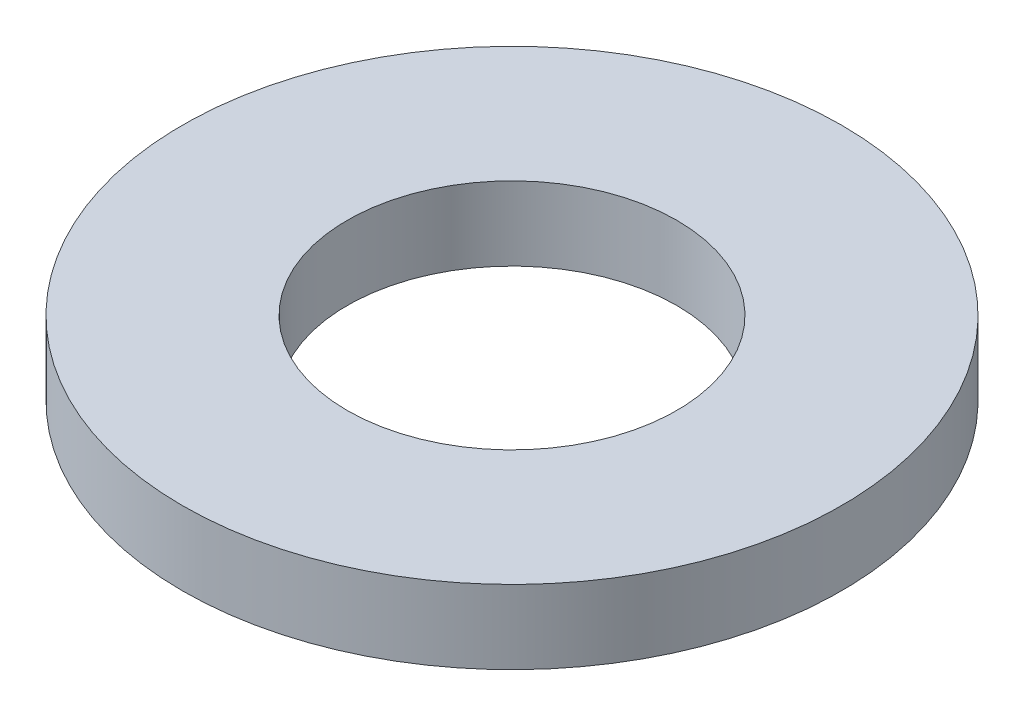
ISO-10303-21;
HEADER;
FILE_DESCRIPTION(('STEP AP214'),'2;1');
FILE_NAME('part.step','',(''),(''),'','','');
FILE_SCHEMA(('AUTOMOTIVE_DESIGN { 1 0 10303 214 1 1 1 1 }'));
ENDSEC;
DATA;
#1=APPLICATION_CONTEXT('core data for automotive mechanical design processes');
#2=APPLICATION_PROTOCOL_DEFINITION('international standard','automotive_design',2000,#1);
#3=PRODUCT_CONTEXT('',#1,'mechanical');
#4=PRODUCT('Part','Part','',(#3));
#5=PRODUCT_RELATED_PRODUCT_CATEGORY('part','',(#4));
#6=PRODUCT_DEFINITION_FORMATION('','',#4);
#7=PRODUCT_DEFINITION_CONTEXT('part definition',#1,'design');
#8=PRODUCT_DEFINITION('design','',#6,#7);
#9=PRODUCT_DEFINITION_SHAPE('','',#8);
#10=(LENGTH_UNIT() NAMED_UNIT(*) SI_UNIT(.MILLI.,.METRE.));
#11=(NAMED_UNIT(*) PLANE_ANGLE_UNIT() SI_UNIT($,.RADIAN.));
#12=(NAMED_UNIT(*) SI_UNIT($,.STERADIAN.) SOLID_ANGLE_UNIT());
#13=UNCERTAINTY_MEASURE_WITH_UNIT(LENGTH_MEASURE(1.E-05),#10,'distance_accuracy_value','');
#14=(GEOMETRIC_REPRESENTATION_CONTEXT(3) GLOBAL_UNCERTAINTY_ASSIGNED_CONTEXT((#13)) GLOBAL_UNIT_ASSIGNED_CONTEXT((#10,
#11,#12)) REPRESENTATION_CONTEXT('',''));
#15=CARTESIAN_POINT('',(0.,0.,0.));
#16=DIRECTION('',(0.,0.,1.));
#17=DIRECTION('',(1.,0.,0.));
#18=AXIS2_PLACEMENT_3D('',#15,#16,#17);
#19=CARTESIAN_POINT('',(0.,0.711199999999995,0.));
#20=DIRECTION('',(0.,-1.,0.));
#21=DIRECTION('',(0.,0.,-1.));
#22=AXIS2_PLACEMENT_3D('',#19,#20,#21);
#23=CYLINDRICAL_SURFACE('',#22,3.175);
#24=CARTESIAN_POINT('',(0.,0.711199999999995,0.));
#25=DIRECTION('',(0.,1.,0.));
#26=DIRECTION('',(0.,0.,1.));
#27=AXIS2_PLACEMENT_3D('',#24,#25,#26);
#28=CIRCLE('',#27,3.175);
#29=CARTESIAN_POINT('',(0.,0.711199999999995,3.175));
#30=VERTEX_POINT('',#29);
#31=EDGE_CURVE('E10',#30,#30,#28,.T.);
#32=ORIENTED_EDGE('',*,*,#31,.F.);
#33=EDGE_LOOP('',(#32));
#34=FACE_BOUND('',#33,.T.);
#35=CARTESIAN_POINT('',(0.,0.,0.));
#36=DIRECTION('',(0.,1.,0.));
#37=DIRECTION('',(0.,0.,1.));
#38=AXIS2_PLACEMENT_3D('',#35,#36,#37);
#39=CIRCLE('',#38,3.175);
#40=CARTESIAN_POINT('',(0.,0.,3.175));
#41=VERTEX_POINT('',#40);
#42=EDGE_CURVE('E37',#41,#41,#39,.T.);
#43=ORIENTED_EDGE('',*,*,#42,.T.);
#44=EDGE_LOOP('',(#43));
#45=FACE_BOUND('',#44,.T.);
#46=ADVANCED_FACE('F34',(#34,#45),#23,.T.);
#47=CARTESIAN_POINT('',(0.,0.711199999999995,0.));
#48=DIRECTION('',(0.,1.,0.));
#49=DIRECTION('',(0.,0.,1.));
#50=AXIS2_PLACEMENT_3D('',#47,#48,#49);
#51=PLANE('',#50);
#52=CARTESIAN_POINT('',(0.,0.711199999999995,0.));
#53=DIRECTION('',(0.,1.,0.));
#54=DIRECTION('',(0.,0.,1.));
#55=AXIS2_PLACEMENT_3D('',#52,#53,#54);
#56=CIRCLE('',#55,1.5875);
#57=CARTESIAN_POINT('',(0.,0.711199999999995,1.5875));
#58=VERTEX_POINT('',#57);
#59=EDGE_CURVE('E46',#58,#58,#56,.T.);
#60=ORIENTED_EDGE('',*,*,#59,.F.);
#61=EDGE_LOOP('',(#60));
#62=FACE_BOUND('',#61,.T.);
#63=ORIENTED_EDGE('',*,*,#31,.T.);
#64=EDGE_LOOP('',(#63));
#65=FACE_BOUND('',#64,.T.);
#66=ADVANCED_FACE('F61',(#62,#65),#51,.T.);
#67=CARTESIAN_POINT('',(0.,0.,0.));
#68=DIRECTION('',(0.,1.,0.));
#69=DIRECTION('',(0.,0.,1.));
#70=AXIS2_PLACEMENT_3D('',#67,#68,#69);
#71=PLANE('',#70);
#72=CARTESIAN_POINT('',(0.,0.,0.));
#73=DIRECTION('',(0.,1.,0.));
#74=DIRECTION('',(0.,0.,1.));
#75=AXIS2_PLACEMENT_3D('',#72,#73,#74);
#76=CIRCLE('',#75,1.5875);
#77=CARTESIAN_POINT('',(0.,0.,1.5875));
#78=VERTEX_POINT('',#77);
#79=EDGE_CURVE('E44',#78,#78,#76,.T.);
#80=ORIENTED_EDGE('',*,*,#79,.T.);
#81=EDGE_LOOP('',(#80));
#82=FACE_BOUND('',#81,.T.);
#83=ORIENTED_EDGE('',*,*,#42,.F.);
#84=EDGE_LOOP('',(#83));
#85=FACE_BOUND('',#84,.T.);
#86=ADVANCED_FACE('F52',(#82,#85),#71,.F.);
#87=CARTESIAN_POINT('',(0.,0.,0.));
#88=DIRECTION('',(0.,1.,0.));
#89=DIRECTION('',(0.,0.,1.));
#90=AXIS2_PLACEMENT_3D('',#87,#88,#89);
#91=CYLINDRICAL_SURFACE('',#90,1.5875);
#92=ORIENTED_EDGE('',*,*,#79,.F.);
#93=EDGE_LOOP('',(#92));
#94=FACE_BOUND('',#93,.T.);
#95=ORIENTED_EDGE('',*,*,#59,.T.);
#96=EDGE_LOOP('',(#95));
#97=FACE_BOUND('',#96,.T.);
#98=ADVANCED_FACE('F55',(#94,#97),#91,.F.);
#99=CLOSED_SHELL('',(#46,#66,#86,#98));
#100=MANIFOLD_SOLID_BREP('B2',#99);
#101=ADVANCED_BREP_SHAPE_REPRESENTATION('',(#18,#100),#14);
#102=SHAPE_DEFINITION_REPRESENTATION(#9,#101);
ENDSEC;
END-ISO-10303-21;
